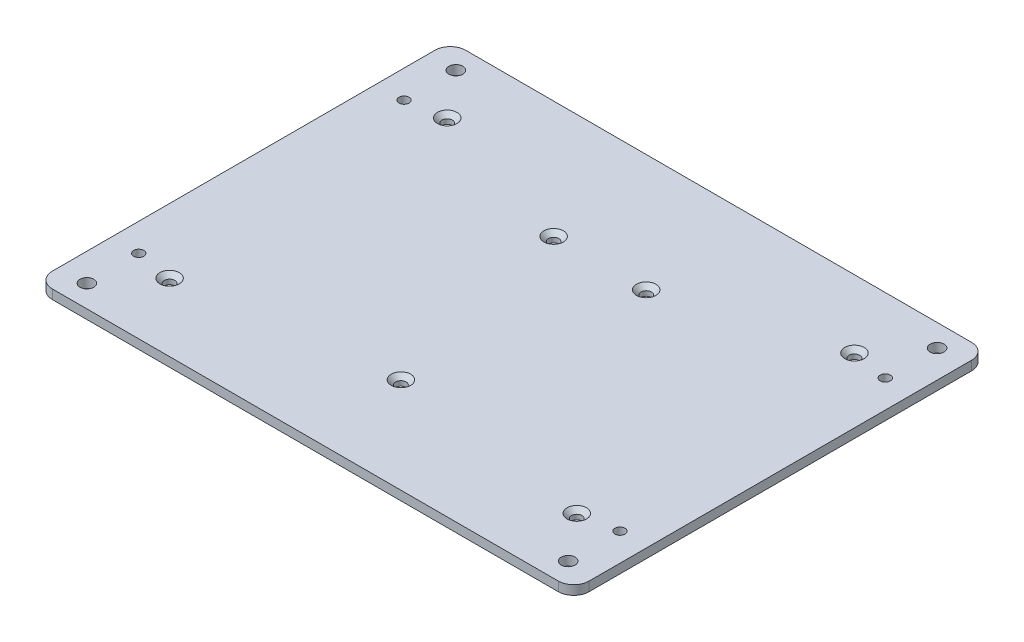
ISO-10303-21;
HEADER;
FILE_DESCRIPTION(('STEP AP214'),'2;1');
FILE_NAME('part.step','',(''),(''),'','','');
FILE_SCHEMA(('AUTOMOTIVE_DESIGN { 1 0 10303 214 1 1 1 1 }'));
ENDSEC;
DATA;
#1=APPLICATION_CONTEXT('core data for automotive mechanical design processes');
#2=APPLICATION_PROTOCOL_DEFINITION('international standard','automotive_design',2000,#1);
#3=PRODUCT_CONTEXT('',#1,'mechanical');
#4=PRODUCT('Part','Part','',(#3));
#5=PRODUCT_RELATED_PRODUCT_CATEGORY('part','',(#4));
#6=PRODUCT_DEFINITION_FORMATION('','',#4);
#7=PRODUCT_DEFINITION_CONTEXT('part definition',#1,'design');
#8=PRODUCT_DEFINITION('design','',#6,#7);
#9=PRODUCT_DEFINITION_SHAPE('','',#8);
#10=(LENGTH_UNIT() NAMED_UNIT(*) SI_UNIT(.MILLI.,.METRE.));
#11=(NAMED_UNIT(*) PLANE_ANGLE_UNIT() SI_UNIT($,.RADIAN.));
#12=(NAMED_UNIT(*) SI_UNIT($,.STERADIAN.) SOLID_ANGLE_UNIT());
#13=UNCERTAINTY_MEASURE_WITH_UNIT(LENGTH_MEASURE(1.E-05),#10,'distance_accuracy_value','');
#14=(GEOMETRIC_REPRESENTATION_CONTEXT(3) GLOBAL_UNCERTAINTY_ASSIGNED_CONTEXT((#13)) GLOBAL_UNIT_ASSIGNED_CONTEXT((#10,
#11,#12)) REPRESENTATION_CONTEXT('',''));
#15=CARTESIAN_POINT('',(0.,0.,0.));
#16=DIRECTION('',(0.,0.,1.));
#17=DIRECTION('',(1.,0.,0.));
#18=AXIS2_PLACEMENT_3D('',#15,#16,#17);
#19=CARTESIAN_POINT('',(-87.,3.,-67.));
#20=DIRECTION('',(1.,0.,0.));
#21=DIRECTION('',(0.,0.,-1.));
#22=AXIS2_PLACEMENT_3D('',#19,#20,#21);
#23=PLANE('',#22);
#24=DIRECTION('',(0.,0.,1.));
#25=VECTOR('',#24,1.);
#26=CARTESIAN_POINT('',(-87.,0.,-67.));
#27=LINE('',#26,#25);
#28=CARTESIAN_POINT('',(-87.,0.,-62.));
#29=VERTEX_POINT('',#28);
#30=CARTESIAN_POINT('',(-87.,0.,62.));
#31=VERTEX_POINT('',#30);
#32=EDGE_CURVE('E173',#29,#31,#27,.T.);
#33=ORIENTED_EDGE('',*,*,#32,.T.);
#34=DIRECTION('',(0.,-1.,0.));
#35=VECTOR('',#34,1.);
#36=CARTESIAN_POINT('',(-87.,3.,62.));
#37=LINE('',#36,#35);
#38=CARTESIAN_POINT('',(-87.,3.,62.));
#39=VERTEX_POINT('',#38);
#40=EDGE_CURVE('E11',#31,#39,#37,.F.);
#41=ORIENTED_EDGE('',*,*,#40,.T.);
#42=DIRECTION('',(0.,0.,1.));
#43=VECTOR('',#42,1.);
#44=CARTESIAN_POINT('',(-87.,3.,-67.));
#45=LINE('',#44,#43);
#46=CARTESIAN_POINT('',(-87.,3.,-62.));
#47=VERTEX_POINT('',#46);
#48=EDGE_CURVE('E141',#47,#39,#45,.T.);
#49=ORIENTED_EDGE('',*,*,#48,.F.);
#50=DIRECTION('',(0.,-1.,0.));
#51=VECTOR('',#50,1.);
#52=CARTESIAN_POINT('',(-87.,3.,-62.));
#53=LINE('',#52,#51);
#54=EDGE_CURVE('E57',#47,#29,#53,.T.);
#55=ORIENTED_EDGE('',*,*,#54,.T.);
#56=EDGE_LOOP('',(#33,#41,#49,#55));
#57=FACE_BOUND('',#56,.T.);
#58=ADVANCED_FACE('F49',(#57),#23,.F.);
#59=CARTESIAN_POINT('',(87.,3.,67.));
#60=DIRECTION('',(0.,0.,-1.));
#61=DIRECTION('',(-1.,0.,0.));
#62=AXIS2_PLACEMENT_3D('',#59,#60,#61);
#63=PLANE('',#62);
#64=DIRECTION('',(1.,0.,0.));
#65=VECTOR('',#64,1.);
#66=CARTESIAN_POINT('',(87.,0.,67.));
#67=LINE('',#66,#65);
#68=CARTESIAN_POINT('',(-81.9999999999999,0.,67.));
#69=VERTEX_POINT('',#68);
#70=CARTESIAN_POINT('',(82.,0.,67.));
#71=VERTEX_POINT('',#70);
#72=EDGE_CURVE('E146',#69,#71,#67,.T.);
#73=ORIENTED_EDGE('',*,*,#72,.T.);
#74=DIRECTION('',(0.,-1.,0.));
#75=VECTOR('',#74,1.);
#76=CARTESIAN_POINT('',(82.,3.,67.));
#77=LINE('',#76,#75);
#78=CARTESIAN_POINT('',(82.,3.,67.));
#79=VERTEX_POINT('',#78);
#80=EDGE_CURVE('E64',#71,#79,#77,.F.);
#81=ORIENTED_EDGE('',*,*,#80,.T.);
#82=DIRECTION('',(1.,0.,0.));
#83=VECTOR('',#82,1.);
#84=CARTESIAN_POINT('',(87.,3.,67.));
#85=LINE('',#84,#83);
#86=CARTESIAN_POINT('',(-81.9999999999999,3.,67.));
#87=VERTEX_POINT('',#86);
#88=EDGE_CURVE('E144',#87,#79,#85,.T.);
#89=ORIENTED_EDGE('',*,*,#88,.F.);
#90=DIRECTION('',(0.,-1.,0.));
#91=VECTOR('',#90,1.);
#92=CARTESIAN_POINT('',(-81.9999999999999,3.,67.));
#93=LINE('',#92,#91);
#94=EDGE_CURVE('E165',#87,#69,#93,.T.);
#95=ORIENTED_EDGE('',*,*,#94,.T.);
#96=EDGE_LOOP('',(#73,#81,#89,#95));
#97=FACE_BOUND('',#96,.T.);
#98=ADVANCED_FACE('F348',(#97),#63,.F.);
#99=CARTESIAN_POINT('',(87.,3.,-67.));
#100=DIRECTION('',(-1.,0.,0.));
#101=DIRECTION('',(0.,0.,1.));
#102=AXIS2_PLACEMENT_3D('',#99,#100,#101);
#103=PLANE('',#102);
#104=DIRECTION('',(0.,0.,-1.));
#105=VECTOR('',#104,1.);
#106=CARTESIAN_POINT('',(87.,0.,-67.));
#107=LINE('',#106,#105);
#108=CARTESIAN_POINT('',(87.,0.,62.));
#109=VERTEX_POINT('',#108);
#110=CARTESIAN_POINT('',(87.,0.,-62.));
#111=VERTEX_POINT('',#110);
#112=EDGE_CURVE('E142',#109,#111,#107,.T.);
#113=ORIENTED_EDGE('',*,*,#112,.T.);
#114=DIRECTION('',(0.,-1.,0.));
#115=VECTOR('',#114,1.);
#116=CARTESIAN_POINT('',(87.,3.,-62.));
#117=LINE('',#116,#115);
#118=CARTESIAN_POINT('',(87.,3.,-62.));
#119=VERTEX_POINT('',#118);
#120=EDGE_CURVE('E120',#111,#119,#117,.F.);
#121=ORIENTED_EDGE('',*,*,#120,.T.);
#122=DIRECTION('',(0.,0.,-1.));
#123=VECTOR('',#122,1.);
#124=CARTESIAN_POINT('',(87.,3.,-67.));
#125=LINE('',#124,#123);
#126=CARTESIAN_POINT('',(87.,3.,62.));
#127=VERTEX_POINT('',#126);
#128=EDGE_CURVE('E185',#127,#119,#125,.T.);
#129=ORIENTED_EDGE('',*,*,#128,.F.);
#130=DIRECTION('',(0.,-1.,0.));
#131=VECTOR('',#130,1.);
#132=CARTESIAN_POINT('',(87.,3.,62.));
#133=LINE('',#132,#131);
#134=EDGE_CURVE('E125',#127,#109,#133,.T.);
#135=ORIENTED_EDGE('',*,*,#134,.T.);
#136=EDGE_LOOP('',(#113,#121,#129,#135));
#137=FACE_BOUND('',#136,.T.);
#138=ADVANCED_FACE('F345',(#137),#103,.F.);
#139=CARTESIAN_POINT('',(87.,3.,-67.));
#140=DIRECTION('',(0.,0.,1.));
#141=DIRECTION('',(1.,0.,0.));
#142=AXIS2_PLACEMENT_3D('',#139,#140,#141);
#143=PLANE('',#142);
#144=DIRECTION('',(-1.,0.,0.));
#145=VECTOR('',#144,1.);
#146=CARTESIAN_POINT('',(87.,3.,-67.));
#147=LINE('',#146,#145);
#148=CARTESIAN_POINT('',(82.,3.,-67.));
#149=VERTEX_POINT('',#148);
#150=CARTESIAN_POINT('',(-82.,3.,-67.));
#151=VERTEX_POINT('',#150);
#152=EDGE_CURVE('E135',#149,#151,#147,.T.);
#153=ORIENTED_EDGE('',*,*,#152,.F.);
#154=DIRECTION('',(0.,-1.,0.));
#155=VECTOR('',#154,1.);
#156=CARTESIAN_POINT('',(82.,3.,-67.));
#157=LINE('',#156,#155);
#158=CARTESIAN_POINT('',(82.,0.,-67.));
#159=VERTEX_POINT('',#158);
#160=EDGE_CURVE('E119',#149,#159,#157,.T.);
#161=ORIENTED_EDGE('',*,*,#160,.T.);
#162=DIRECTION('',(-1.,0.,0.));
#163=VECTOR('',#162,1.);
#164=CARTESIAN_POINT('',(87.,0.,-67.));
#165=LINE('',#164,#163);
#166=CARTESIAN_POINT('',(-82.,0.,-67.));
#167=VERTEX_POINT('',#166);
#168=EDGE_CURVE('E132',#159,#167,#165,.T.);
#169=ORIENTED_EDGE('',*,*,#168,.T.);
#170=DIRECTION('',(0.,-1.,0.));
#171=VECTOR('',#170,1.);
#172=CARTESIAN_POINT('',(-82.,3.,-67.));
#173=LINE('',#172,#171);
#174=EDGE_CURVE('E137',#167,#151,#173,.F.);
#175=ORIENTED_EDGE('',*,*,#174,.T.);
#176=EDGE_LOOP('',(#153,#161,#169,#175));
#177=FACE_BOUND('',#176,.T.);
#178=ADVANCED_FACE('F131',(#177),#143,.F.);
#179=CARTESIAN_POINT('',(0.,3.,0.));
#180=DIRECTION('',(0.,-1.,0.));
#181=DIRECTION('',(0.,0.,-1.));
#182=AXIS2_PLACEMENT_3D('',#179,#180,#181);
#183=PLANE('',#182);
#184=CARTESIAN_POINT('',(-77.999137931034,3.,-59.799137931034));
#185=DIRECTION('',(0.,-1.,0.));
#186=DIRECTION('',(0.,0.,-1.));
#187=AXIS2_PLACEMENT_3D('',#184,#185,#186);
#188=CIRCLE('',#187,2.25);
#189=CARTESIAN_POINT('',(-77.999137931034,3.,-62.049137931034));
#190=VERTEX_POINT('',#189);
#191=EDGE_CURVE('E290',#190,#190,#188,.T.);
#192=ORIENTED_EDGE('',*,*,#191,.T.);
#193=EDGE_LOOP('',(#192));
#194=FACE_BOUND('',#193,.T.);
#195=CARTESIAN_POINT('',(77.999137931034,3.,-59.799137931034));
#196=DIRECTION('',(0.,-1.,0.));
#197=DIRECTION('',(0.,0.,-1.));
#198=AXIS2_PLACEMENT_3D('',#195,#196,#197);
#199=CIRCLE('',#198,2.25);
#200=CARTESIAN_POINT('',(77.999137931034,3.,-62.049137931034));
#201=VERTEX_POINT('',#200);
#202=EDGE_CURVE('E284',#201,#201,#199,.T.);
#203=ORIENTED_EDGE('',*,*,#202,.T.);
#204=EDGE_LOOP('',(#203));
#205=FACE_BOUND('',#204,.T.);
#206=CARTESIAN_POINT('',(77.999137931034,3.,59.799137931034));
#207=DIRECTION('',(0.,-1.,0.));
#208=DIRECTION('',(0.,0.,-1.));
#209=AXIS2_PLACEMENT_3D('',#206,#207,#208);
#210=CIRCLE('',#209,2.25);
#211=CARTESIAN_POINT('',(77.999137931034,3.,57.549137931034));
#212=VERTEX_POINT('',#211);
#213=EDGE_CURVE('E278',#212,#212,#210,.T.);
#214=ORIENTED_EDGE('',*,*,#213,.T.);
#215=EDGE_LOOP('',(#214));
#216=FACE_BOUND('',#215,.T.);
#217=CARTESIAN_POINT('',(-77.999137931034,3.,59.799137931034));
#218=DIRECTION('',(0.,-1.,0.));
#219=DIRECTION('',(0.,0.,-1.));
#220=AXIS2_PLACEMENT_3D('',#217,#218,#219);
#221=CIRCLE('',#220,2.25);
#222=CARTESIAN_POINT('',(-77.999137931034,3.,57.549137931034));
#223=VERTEX_POINT('',#222);
#224=EDGE_CURVE('E272',#223,#223,#221,.T.);
#225=ORIENTED_EDGE('',*,*,#224,.T.);
#226=EDGE_LOOP('',(#225));
#227=FACE_BOUND('',#226,.T.);
#228=CARTESIAN_POINT('',(0.,3.,36.));
#229=DIRECTION('',(0.,1.,0.));
#230=DIRECTION('',(0.,0.,1.));
#231=AXIS2_PLACEMENT_3D('',#228,#229,#230);
#232=CIRCLE('',#231,3.15);
#233=CARTESIAN_POINT('',(0.,3.,39.15));
#234=VERTEX_POINT('',#233);
#235=EDGE_CURVE('E269',#234,#234,#232,.T.);
#236=ORIENTED_EDGE('',*,*,#235,.F.);
#237=EDGE_LOOP('',(#236));
#238=FACE_BOUND('',#237,.T.);
#239=CARTESIAN_POINT('',(14.5,3.,-29.));
#240=DIRECTION('',(0.,1.,0.));
#241=DIRECTION('',(0.,0.,1.));
#242=AXIS2_PLACEMENT_3D('',#239,#240,#241);
#243=CIRCLE('',#242,3.15);
#244=CARTESIAN_POINT('',(14.5,3.,-25.85));
#245=VERTEX_POINT('',#244);
#246=EDGE_CURVE('E260',#245,#245,#243,.T.);
#247=ORIENTED_EDGE('',*,*,#246,.F.);
#248=EDGE_LOOP('',(#247));
#249=FACE_BOUND('',#248,.T.);
#250=CARTESIAN_POINT('',(-15.5,3.,-29.));
#251=DIRECTION('',(0.,1.,0.));
#252=DIRECTION('',(0.,0.,1.));
#253=AXIS2_PLACEMENT_3D('',#250,#251,#252);
#254=CIRCLE('',#253,3.15);
#255=CARTESIAN_POINT('',(-15.5,3.,-25.85));
#256=VERTEX_POINT('',#255);
#257=EDGE_CURVE('E251',#256,#256,#254,.T.);
#258=ORIENTED_EDGE('',*,*,#257,.F.);
#259=EDGE_LOOP('',(#258));
#260=FACE_BOUND('',#259,.T.);
#261=CARTESIAN_POINT('',(-66.,3.,-45.));
#262=DIRECTION('',(0.,1.,0.));
#263=DIRECTION('',(0.,0.,1.));
#264=AXIS2_PLACEMENT_3D('',#261,#262,#263);
#265=CIRCLE('',#264,3.15);
#266=CARTESIAN_POINT('',(-66.,3.,-41.85));
#267=VERTEX_POINT('',#266);
#268=EDGE_CURVE('E242',#267,#267,#265,.T.);
#269=ORIENTED_EDGE('',*,*,#268,.F.);
#270=EDGE_LOOP('',(#269));
#271=FACE_BOUND('',#270,.T.);
#272=CARTESIAN_POINT('',(66.,3.,-45.));
#273=DIRECTION('',(0.,1.,0.));
#274=DIRECTION('',(0.,0.,1.));
#275=AXIS2_PLACEMENT_3D('',#272,#273,#274);
#276=CIRCLE('',#275,3.15);
#277=CARTESIAN_POINT('',(66.,3.,-41.85));
#278=VERTEX_POINT('',#277);
#279=EDGE_CURVE('E233',#278,#278,#276,.T.);
#280=ORIENTED_EDGE('',*,*,#279,.F.);
#281=EDGE_LOOP('',(#280));
#282=FACE_BOUND('',#281,.T.);
#283=CARTESIAN_POINT('',(-66.,3.,45.));
#284=DIRECTION('',(0.,1.,0.));
#285=DIRECTION('',(0.,0.,1.));
#286=AXIS2_PLACEMENT_3D('',#283,#284,#285);
#287=CIRCLE('',#286,3.15);
#288=CARTESIAN_POINT('',(-66.,3.,48.15));
#289=VERTEX_POINT('',#288);
#290=EDGE_CURVE('E224',#289,#289,#287,.T.);
#291=ORIENTED_EDGE('',*,*,#290,.F.);
#292=EDGE_LOOP('',(#291));
#293=FACE_BOUND('',#292,.T.);
#294=CARTESIAN_POINT('',(66.,3.,45.));
#295=DIRECTION('',(0.,1.,0.));
#296=DIRECTION('',(0.,0.,1.));
#297=AXIS2_PLACEMENT_3D('',#294,#295,#296);
#298=CIRCLE('',#297,3.15);
#299=CARTESIAN_POINT('',(66.,3.,48.15));
#300=VERTEX_POINT('',#299);
#301=EDGE_CURVE('E215',#300,#300,#298,.T.);
#302=ORIENTED_EDGE('',*,*,#301,.F.);
#303=EDGE_LOOP('',(#302));
#304=FACE_BOUND('',#303,.T.);
#305=CARTESIAN_POINT('',(-77.999137931034,3.,-42.999137931034));
#306=DIRECTION('',(0.,1.,0.));
#307=DIRECTION('',(0.,0.,1.));
#308=AXIS2_PLACEMENT_3D('',#305,#306,#307);
#309=CIRCLE('',#308,1.65);
#310=CARTESIAN_POINT('',(-77.999137931034,3.,-41.349137931034));
#311=VERTEX_POINT('',#310);
#312=EDGE_CURVE('E206',#311,#311,#309,.T.);
#313=ORIENTED_EDGE('',*,*,#312,.F.);
#314=EDGE_LOOP('',(#313));
#315=FACE_BOUND('',#314,.T.);
#316=CARTESIAN_POINT('',(77.99913793103,3.,-42.999137931034));
#317=DIRECTION('',(0.,1.,0.));
#318=DIRECTION('',(0.,0.,1.));
#319=AXIS2_PLACEMENT_3D('',#316,#317,#318);
#320=CIRCLE('',#319,1.65);
#321=CARTESIAN_POINT('',(77.99913793103,3.,-41.349137931034));
#322=VERTEX_POINT('',#321);
#323=EDGE_CURVE('E200',#322,#322,#320,.T.);
#324=ORIENTED_EDGE('',*,*,#323,.F.);
#325=EDGE_LOOP('',(#324));
#326=FACE_BOUND('',#325,.T.);
#327=CARTESIAN_POINT('',(77.99913793103,3.,42.999137931035));
#328=DIRECTION('',(0.,1.,0.));
#329=DIRECTION('',(0.,0.,1.));
#330=AXIS2_PLACEMENT_3D('',#327,#328,#329);
#331=CIRCLE('',#330,1.65);
#332=CARTESIAN_POINT('',(77.99913793103,3.,44.649137931035));
#333=VERTEX_POINT('',#332);
#334=EDGE_CURVE('E194',#333,#333,#331,.T.);
#335=ORIENTED_EDGE('',*,*,#334,.F.);
#336=EDGE_LOOP('',(#335));
#337=FACE_BOUND('',#336,.T.);
#338=CARTESIAN_POINT('',(-77.999137931034,3.,42.999137931035));
#339=DIRECTION('',(0.,1.,0.));
#340=DIRECTION('',(0.,0.,1.));
#341=AXIS2_PLACEMENT_3D('',#338,#339,#340);
#342=CIRCLE('',#341,1.65);
#343=CARTESIAN_POINT('',(-77.999137931034,3.,44.649137931035));
#344=VERTEX_POINT('',#343);
#345=EDGE_CURVE('E181',#344,#344,#342,.T.);
#346=ORIENTED_EDGE('',*,*,#345,.F.);
#347=EDGE_LOOP('',(#346));
#348=FACE_BOUND('',#347,.T.);
#349=ORIENTED_EDGE('',*,*,#128,.T.);
#350=CARTESIAN_POINT('',(82.,3.,-62.));
#351=DIRECTION('',(0.,-1.,0.));
#352=DIRECTION('',(0.,0.,-1.));
#353=AXIS2_PLACEMENT_3D('',#350,#351,#352);
#354=CIRCLE('',#353,5.);
#355=EDGE_CURVE('E163',#119,#149,#354,.F.);
#356=ORIENTED_EDGE('',*,*,#355,.T.);
#357=ORIENTED_EDGE('',*,*,#152,.T.);
#358=CARTESIAN_POINT('',(-82.,3.,-62.));
#359=DIRECTION('',(0.,-1.,0.));
#360=DIRECTION('',(0.,0.,-1.));
#361=AXIS2_PLACEMENT_3D('',#358,#359,#360);
#362=CIRCLE('',#361,5.);
#363=EDGE_CURVE('E158',#151,#47,#362,.F.);
#364=ORIENTED_EDGE('',*,*,#363,.T.);
#365=ORIENTED_EDGE('',*,*,#48,.T.);
#366=CARTESIAN_POINT('',(-81.9999999999999,3.,62.));
#367=DIRECTION('',(0.,-1.,0.));
#368=DIRECTION('',(0.,0.,-1.));
#369=AXIS2_PLACEMENT_3D('',#366,#367,#368);
#370=CIRCLE('',#369,5.);
#371=EDGE_CURVE('E71',#39,#87,#370,.F.);
#372=ORIENTED_EDGE('',*,*,#371,.T.);
#373=ORIENTED_EDGE('',*,*,#88,.T.);
#374=CARTESIAN_POINT('',(82.,3.,62.));
#375=DIRECTION('',(0.,-1.,0.));
#376=DIRECTION('',(0.,0.,-1.));
#377=AXIS2_PLACEMENT_3D('',#374,#375,#376);
#378=CIRCLE('',#377,5.);
#379=EDGE_CURVE('E161',#79,#127,#378,.F.);
#380=ORIENTED_EDGE('',*,*,#379,.T.);
#381=EDGE_LOOP('',(#349,#356,#357,#364,#365,#372,#373,#380));
#382=FACE_BOUND('',#381,.T.);
#383=ADVANCED_FACE('F302',(#194,#205,#216,#227,#238,#249,#260,#271,#282,#293,#304,#315,#326,
#337,#348,#382),#183,.F.);
#384=CARTESIAN_POINT('',(0.,0.,0.));
#385=DIRECTION('',(0.,-1.,0.));
#386=DIRECTION('',(0.,0.,-1.));
#387=AXIS2_PLACEMENT_3D('',#384,#385,#386);
#388=PLANE('',#387);
#389=CARTESIAN_POINT('',(-77.999137931034,0.,-59.799137931034));
#390=DIRECTION('',(0.,-1.,0.));
#391=DIRECTION('',(0.,0.,-1.));
#392=AXIS2_PLACEMENT_3D('',#389,#390,#391);
#393=CIRCLE('',#392,2.25);
#394=CARTESIAN_POINT('',(-77.999137931034,0.,-62.049137931034));
#395=VERTEX_POINT('',#394);
#396=EDGE_CURVE('E293',#395,#395,#393,.T.);
#397=ORIENTED_EDGE('',*,*,#396,.F.);
#398=EDGE_LOOP('',(#397));
#399=FACE_BOUND('',#398,.T.);
#400=CARTESIAN_POINT('',(77.999137931034,0.,-59.799137931034));
#401=DIRECTION('',(0.,-1.,0.));
#402=DIRECTION('',(0.,0.,-1.));
#403=AXIS2_PLACEMENT_3D('',#400,#401,#402);
#404=CIRCLE('',#403,2.25);
#405=CARTESIAN_POINT('',(77.999137931034,0.,-62.049137931034));
#406=VERTEX_POINT('',#405);
#407=EDGE_CURVE('E287',#406,#406,#404,.T.);
#408=ORIENTED_EDGE('',*,*,#407,.F.);
#409=EDGE_LOOP('',(#408));
#410=FACE_BOUND('',#409,.T.);
#411=CARTESIAN_POINT('',(77.999137931034,0.,59.799137931034));
#412=DIRECTION('',(0.,-1.,0.));
#413=DIRECTION('',(0.,0.,-1.));
#414=AXIS2_PLACEMENT_3D('',#411,#412,#413);
#415=CIRCLE('',#414,2.25);
#416=CARTESIAN_POINT('',(77.999137931034,0.,57.549137931034));
#417=VERTEX_POINT('',#416);
#418=EDGE_CURVE('E281',#417,#417,#415,.T.);
#419=ORIENTED_EDGE('',*,*,#418,.F.);
#420=EDGE_LOOP('',(#419));
#421=FACE_BOUND('',#420,.T.);
#422=CARTESIAN_POINT('',(-77.999137931034,0.,59.799137931034));
#423=DIRECTION('',(0.,-1.,0.));
#424=DIRECTION('',(0.,0.,-1.));
#425=AXIS2_PLACEMENT_3D('',#422,#423,#424);
#426=CIRCLE('',#425,2.25);
#427=CARTESIAN_POINT('',(-77.999137931034,0.,57.549137931034));
#428=VERTEX_POINT('',#427);
#429=EDGE_CURVE('E275',#428,#428,#426,.T.);
#430=ORIENTED_EDGE('',*,*,#429,.F.);
#431=EDGE_LOOP('',(#430));
#432=FACE_BOUND('',#431,.T.);
#433=CARTESIAN_POINT('',(0.,0.,36.));
#434=DIRECTION('',(0.,1.,0.));
#435=DIRECTION('',(0.,0.,1.));
#436=AXIS2_PLACEMENT_3D('',#433,#434,#435);
#437=CIRCLE('',#436,1.7);
#438=CARTESIAN_POINT('',(0.,0.,37.7));
#439=VERTEX_POINT('',#438);
#440=EDGE_CURVE('E263',#439,#439,#437,.T.);
#441=ORIENTED_EDGE('',*,*,#440,.T.);
#442=EDGE_LOOP('',(#441));
#443=FACE_BOUND('',#442,.T.);
#444=CARTESIAN_POINT('',(14.5,0.,-29.));
#445=DIRECTION('',(0.,1.,0.));
#446=DIRECTION('',(0.,0.,1.));
#447=AXIS2_PLACEMENT_3D('',#444,#445,#446);
#448=CIRCLE('',#447,1.7);
#449=CARTESIAN_POINT('',(14.5,0.,-27.3));
#450=VERTEX_POINT('',#449);
#451=EDGE_CURVE('E254',#450,#450,#448,.T.);
#452=ORIENTED_EDGE('',*,*,#451,.T.);
#453=EDGE_LOOP('',(#452));
#454=FACE_BOUND('',#453,.T.);
#455=CARTESIAN_POINT('',(-15.5,0.,-29.));
#456=DIRECTION('',(0.,1.,0.));
#457=DIRECTION('',(0.,0.,1.));
#458=AXIS2_PLACEMENT_3D('',#455,#456,#457);
#459=CIRCLE('',#458,1.7);
#460=CARTESIAN_POINT('',(-15.5,0.,-27.3));
#461=VERTEX_POINT('',#460);
#462=EDGE_CURVE('E245',#461,#461,#459,.T.);
#463=ORIENTED_EDGE('',*,*,#462,.T.);
#464=EDGE_LOOP('',(#463));
#465=FACE_BOUND('',#464,.T.);
#466=CARTESIAN_POINT('',(-66.,0.,-45.));
#467=DIRECTION('',(0.,1.,0.));
#468=DIRECTION('',(0.,0.,1.));
#469=AXIS2_PLACEMENT_3D('',#466,#467,#468);
#470=CIRCLE('',#469,1.69999999999999);
#471=CARTESIAN_POINT('',(-66.,0.,-43.3));
#472=VERTEX_POINT('',#471);
#473=EDGE_CURVE('E236',#472,#472,#470,.T.);
#474=ORIENTED_EDGE('',*,*,#473,.T.);
#475=EDGE_LOOP('',(#474));
#476=FACE_BOUND('',#475,.T.);
#477=CARTESIAN_POINT('',(66.,0.,-45.));
#478=DIRECTION('',(0.,1.,0.));
#479=DIRECTION('',(0.,0.,1.));
#480=AXIS2_PLACEMENT_3D('',#477,#478,#479);
#481=CIRCLE('',#480,1.69999999999999);
#482=CARTESIAN_POINT('',(66.,0.,-43.3));
#483=VERTEX_POINT('',#482);
#484=EDGE_CURVE('E227',#483,#483,#481,.T.);
#485=ORIENTED_EDGE('',*,*,#484,.T.);
#486=EDGE_LOOP('',(#485));
#487=FACE_BOUND('',#486,.T.);
#488=CARTESIAN_POINT('',(-66.,0.,45.));
#489=DIRECTION('',(0.,1.,0.));
#490=DIRECTION('',(0.,0.,1.));
#491=AXIS2_PLACEMENT_3D('',#488,#489,#490);
#492=CIRCLE('',#491,1.69999999999999);
#493=CARTESIAN_POINT('',(-66.,0.,46.7));
#494=VERTEX_POINT('',#493);
#495=EDGE_CURVE('E218',#494,#494,#492,.T.);
#496=ORIENTED_EDGE('',*,*,#495,.T.);
#497=EDGE_LOOP('',(#496));
#498=FACE_BOUND('',#497,.T.);
#499=CARTESIAN_POINT('',(66.,0.,45.));
#500=DIRECTION('',(0.,1.,0.));
#501=DIRECTION('',(0.,0.,1.));
#502=AXIS2_PLACEMENT_3D('',#499,#500,#501);
#503=CIRCLE('',#502,1.69999999999999);
#504=CARTESIAN_POINT('',(66.,0.,46.7));
#505=VERTEX_POINT('',#504);
#506=EDGE_CURVE('E209',#505,#505,#503,.T.);
#507=ORIENTED_EDGE('',*,*,#506,.T.);
#508=EDGE_LOOP('',(#507));
#509=FACE_BOUND('',#508,.T.);
#510=CARTESIAN_POINT('',(-77.999137931034,0.,-42.999137931034));
#511=DIRECTION('',(0.,1.,0.));
#512=DIRECTION('',(0.,0.,1.));
#513=AXIS2_PLACEMENT_3D('',#510,#511,#512);
#514=CIRCLE('',#513,1.65);
#515=CARTESIAN_POINT('',(-77.999137931034,0.,-41.349137931034));
#516=VERTEX_POINT('',#515);
#517=EDGE_CURVE('E203',#516,#516,#514,.T.);
#518=ORIENTED_EDGE('',*,*,#517,.T.);
#519=EDGE_LOOP('',(#518));
#520=FACE_BOUND('',#519,.T.);
#521=CARTESIAN_POINT('',(77.99913793103,0.,-42.999137931034));
#522=DIRECTION('',(0.,1.,0.));
#523=DIRECTION('',(0.,0.,1.));
#524=AXIS2_PLACEMENT_3D('',#521,#522,#523);
#525=CIRCLE('',#524,1.65);
#526=CARTESIAN_POINT('',(77.99913793103,0.,-41.349137931034));
#527=VERTEX_POINT('',#526);
#528=EDGE_CURVE('E197',#527,#527,#525,.T.);
#529=ORIENTED_EDGE('',*,*,#528,.T.);
#530=EDGE_LOOP('',(#529));
#531=FACE_BOUND('',#530,.T.);
#532=CARTESIAN_POINT('',(77.99913793103,0.,42.999137931035));
#533=DIRECTION('',(0.,1.,0.));
#534=DIRECTION('',(0.,0.,1.));
#535=AXIS2_PLACEMENT_3D('',#532,#533,#534);
#536=CIRCLE('',#535,1.65);
#537=CARTESIAN_POINT('',(77.99913793103,0.,44.649137931035));
#538=VERTEX_POINT('',#537);
#539=EDGE_CURVE('E191',#538,#538,#536,.T.);
#540=ORIENTED_EDGE('',*,*,#539,.T.);
#541=EDGE_LOOP('',(#540));
#542=FACE_BOUND('',#541,.T.);
#543=CARTESIAN_POINT('',(-77.999137931034,0.,42.999137931035));
#544=DIRECTION('',(0.,1.,0.));
#545=DIRECTION('',(0.,0.,1.));
#546=AXIS2_PLACEMENT_3D('',#543,#544,#545);
#547=CIRCLE('',#546,1.65);
#548=CARTESIAN_POINT('',(-77.999137931034,0.,44.649137931035));
#549=VERTEX_POINT('',#548);
#550=EDGE_CURVE('E178',#549,#549,#547,.T.);
#551=ORIENTED_EDGE('',*,*,#550,.T.);
#552=EDGE_LOOP('',(#551));
#553=FACE_BOUND('',#552,.T.);
#554=ORIENTED_EDGE('',*,*,#168,.F.);
#555=CARTESIAN_POINT('',(82.,0.,-62.));
#556=DIRECTION('',(0.,-1.,0.));
#557=DIRECTION('',(0.,0.,-1.));
#558=AXIS2_PLACEMENT_3D('',#555,#556,#557);
#559=CIRCLE('',#558,5.);
#560=EDGE_CURVE('E115',#159,#111,#559,.T.);
#561=ORIENTED_EDGE('',*,*,#560,.T.);
#562=ORIENTED_EDGE('',*,*,#112,.F.);
#563=CARTESIAN_POINT('',(82.,0.,62.));
#564=DIRECTION('',(0.,-1.,0.));
#565=DIRECTION('',(0.,0.,-1.));
#566=AXIS2_PLACEMENT_3D('',#563,#564,#565);
#567=CIRCLE('',#566,5.);
#568=EDGE_CURVE('E126',#109,#71,#567,.T.);
#569=ORIENTED_EDGE('',*,*,#568,.T.);
#570=ORIENTED_EDGE('',*,*,#72,.F.);
#571=CARTESIAN_POINT('',(-81.9999999999999,0.,62.));
#572=DIRECTION('',(0.,-1.,0.));
#573=DIRECTION('',(0.,0.,-1.));
#574=AXIS2_PLACEMENT_3D('',#571,#572,#573);
#575=CIRCLE('',#574,5.);
#576=EDGE_CURVE('E152',#69,#31,#575,.T.);
#577=ORIENTED_EDGE('',*,*,#576,.T.);
#578=ORIENTED_EDGE('',*,*,#32,.F.);
#579=CARTESIAN_POINT('',(-82.,0.,-62.));
#580=DIRECTION('',(0.,-1.,0.));
#581=DIRECTION('',(0.,0.,-1.));
#582=AXIS2_PLACEMENT_3D('',#579,#580,#581);
#583=CIRCLE('',#582,5.);
#584=EDGE_CURVE('E136',#29,#167,#583,.T.);
#585=ORIENTED_EDGE('',*,*,#584,.T.);
#586=EDGE_LOOP('',(#554,#561,#562,#569,#570,#577,#578,#585));
#587=FACE_BOUND('',#586,.T.);
#588=ADVANCED_FACE('F139',(#399,#410,#421,#432,#443,#454,#465,#476,#487,#498,#509,#520,#531,
#542,#553,#587),#388,.T.);
#589=CARTESIAN_POINT('',(-77.999137931034,3.,42.999137931035));
#590=DIRECTION('',(0.,1.,0.));
#591=DIRECTION('',(0.,0.,1.));
#592=AXIS2_PLACEMENT_3D('',#589,#590,#591);
#593=CYLINDRICAL_SURFACE('',#592,1.65);
#594=ORIENTED_EDGE('',*,*,#550,.F.);
#595=EDGE_LOOP('',(#594));
#596=FACE_BOUND('',#595,.T.);
#597=ORIENTED_EDGE('',*,*,#345,.T.);
#598=EDGE_LOOP('',(#597));
#599=FACE_BOUND('',#598,.T.);
#600=ADVANCED_FACE('F301',(#596,#599),#593,.F.);
#601=CARTESIAN_POINT('',(77.99913793103,3.,42.999137931035));
#602=DIRECTION('',(0.,1.,0.));
#603=DIRECTION('',(0.,0.,1.));
#604=AXIS2_PLACEMENT_3D('',#601,#602,#603);
#605=CYLINDRICAL_SURFACE('',#604,1.65);
#606=ORIENTED_EDGE('',*,*,#539,.F.);
#607=EDGE_LOOP('',(#606));
#608=FACE_BOUND('',#607,.T.);
#609=ORIENTED_EDGE('',*,*,#334,.T.);
#610=EDGE_LOOP('',(#609));
#611=FACE_BOUND('',#610,.T.);
#612=ADVANCED_FACE('F334',(#608,#611),#605,.F.);
#613=CARTESIAN_POINT('',(77.99913793103,3.,-42.999137931034));
#614=DIRECTION('',(0.,1.,0.));
#615=DIRECTION('',(0.,0.,1.));
#616=AXIS2_PLACEMENT_3D('',#613,#614,#615);
#617=CYLINDRICAL_SURFACE('',#616,1.65);
#618=ORIENTED_EDGE('',*,*,#528,.F.);
#619=EDGE_LOOP('',(#618));
#620=FACE_BOUND('',#619,.T.);
#621=ORIENTED_EDGE('',*,*,#323,.T.);
#622=EDGE_LOOP('',(#621));
#623=FACE_BOUND('',#622,.T.);
#624=ADVANCED_FACE('F584',(#620,#623),#617,.F.);
#625=CARTESIAN_POINT('',(-77.999137931034,3.,-42.999137931034));
#626=DIRECTION('',(0.,1.,0.));
#627=DIRECTION('',(0.,0.,1.));
#628=AXIS2_PLACEMENT_3D('',#625,#626,#627);
#629=CYLINDRICAL_SURFACE('',#628,1.65);
#630=ORIENTED_EDGE('',*,*,#517,.F.);
#631=EDGE_LOOP('',(#630));
#632=FACE_BOUND('',#631,.T.);
#633=ORIENTED_EDGE('',*,*,#312,.T.);
#634=EDGE_LOOP('',(#633));
#635=FACE_BOUND('',#634,.T.);
#636=ADVANCED_FACE('F372',(#632,#635),#629,.F.);
#637=CARTESIAN_POINT('',(82.,3.,-62.));
#638=DIRECTION('',(0.,-1.,0.));
#639=DIRECTION('',(0.,0.,-1.));
#640=AXIS2_PLACEMENT_3D('',#637,#638,#639);
#641=CYLINDRICAL_SURFACE('',#640,5.);
#642=ORIENTED_EDGE('',*,*,#355,.F.);
#643=ORIENTED_EDGE('',*,*,#120,.F.);
#644=ORIENTED_EDGE('',*,*,#560,.F.);
#645=ORIENTED_EDGE('',*,*,#160,.F.);
#646=EDGE_LOOP('',(#642,#643,#644,#645));
#647=FACE_BOUND('',#646,.T.);
#648=ADVANCED_FACE('F118',(#647),#641,.T.);
#649=CARTESIAN_POINT('',(82.,3.,62.));
#650=DIRECTION('',(0.,-1.,0.));
#651=DIRECTION('',(0.,0.,-1.));
#652=AXIS2_PLACEMENT_3D('',#649,#650,#651);
#653=CYLINDRICAL_SURFACE('',#652,5.);
#654=ORIENTED_EDGE('',*,*,#379,.F.);
#655=ORIENTED_EDGE('',*,*,#80,.F.);
#656=ORIENTED_EDGE('',*,*,#568,.F.);
#657=ORIENTED_EDGE('',*,*,#134,.F.);
#658=EDGE_LOOP('',(#654,#655,#656,#657));
#659=FACE_BOUND('',#658,.T.);
#660=ADVANCED_FACE('F347',(#659),#653,.T.);
#661=CARTESIAN_POINT('',(-81.9999999999999,3.,62.));
#662=DIRECTION('',(0.,-1.,0.));
#663=DIRECTION('',(0.,0.,-1.));
#664=AXIS2_PLACEMENT_3D('',#661,#662,#663);
#665=CYLINDRICAL_SURFACE('',#664,5.);
#666=ORIENTED_EDGE('',*,*,#371,.F.);
#667=ORIENTED_EDGE('',*,*,#40,.F.);
#668=ORIENTED_EDGE('',*,*,#576,.F.);
#669=ORIENTED_EDGE('',*,*,#94,.F.);
#670=EDGE_LOOP('',(#666,#667,#668,#669));
#671=FACE_BOUND('',#670,.T.);
#672=ADVANCED_FACE('F351',(#671),#665,.T.);
#673=CARTESIAN_POINT('',(-82.,3.,-62.));
#674=DIRECTION('',(0.,-1.,0.));
#675=DIRECTION('',(0.,0.,-1.));
#676=AXIS2_PLACEMENT_3D('',#673,#674,#675);
#677=CYLINDRICAL_SURFACE('',#676,5.);
#678=ORIENTED_EDGE('',*,*,#363,.F.);
#679=ORIENTED_EDGE('',*,*,#174,.F.);
#680=ORIENTED_EDGE('',*,*,#584,.F.);
#681=ORIENTED_EDGE('',*,*,#54,.F.);
#682=EDGE_LOOP('',(#678,#679,#680,#681));
#683=FACE_BOUND('',#682,.T.);
#684=ADVANCED_FACE('F51',(#683),#677,.T.);
#685=CARTESIAN_POINT('',(66.,3.,45.));
#686=DIRECTION('',(0.,1.,0.));
#687=DIRECTION('',(0.,0.,1.));
#688=AXIS2_PLACEMENT_3D('',#685,#686,#687);
#689=CYLINDRICAL_SURFACE('',#688,1.69999999999999);
#690=ORIENTED_EDGE('',*,*,#506,.F.);
#691=EDGE_LOOP('',(#690));
#692=FACE_BOUND('',#691,.T.);
#693=CARTESIAN_POINT('',(66.,1.55,45.));
#694=DIRECTION('',(0.,1.,0.));
#695=DIRECTION('',(0.,0.,1.));
#696=AXIS2_PLACEMENT_3D('',#693,#694,#695);
#697=CIRCLE('',#696,1.69999999999999);
#698=CARTESIAN_POINT('',(66.,1.55,46.7));
#699=VERTEX_POINT('',#698);
#700=EDGE_CURVE('E212',#699,#699,#697,.T.);
#701=ORIENTED_EDGE('',*,*,#700,.T.);
#702=EDGE_LOOP('',(#701));
#703=FACE_BOUND('',#702,.T.);
#704=ADVANCED_FACE('F353',(#692,#703),#689,.F.);
#705=CARTESIAN_POINT('',(66.,3.,45.));
#706=DIRECTION('',(0.,1.,0.));
#707=DIRECTION('',(0.,0.,1.));
#708=AXIS2_PLACEMENT_3D('',#705,#706,#707);
#709=CONICAL_SURFACE('',#708,3.15,0.78539816339745);
#710=ORIENTED_EDGE('',*,*,#700,.F.);
#711=EDGE_LOOP('',(#710));
#712=FACE_BOUND('',#711,.T.);
#713=ORIENTED_EDGE('',*,*,#301,.T.);
#714=EDGE_LOOP('',(#713));
#715=FACE_BOUND('',#714,.T.);
#716=ADVANCED_FACE('F358',(#712,#715),#709,.F.);
#717=CARTESIAN_POINT('',(-66.,3.,45.));
#718=DIRECTION('',(0.,1.,0.));
#719=DIRECTION('',(0.,0.,1.));
#720=AXIS2_PLACEMENT_3D('',#717,#718,#719);
#721=CYLINDRICAL_SURFACE('',#720,1.69999999999999);
#722=ORIENTED_EDGE('',*,*,#495,.F.);
#723=EDGE_LOOP('',(#722));
#724=FACE_BOUND('',#723,.T.);
#725=CARTESIAN_POINT('',(-66.,1.55,45.));
#726=DIRECTION('',(0.,1.,0.));
#727=DIRECTION('',(0.,0.,1.));
#728=AXIS2_PLACEMENT_3D('',#725,#726,#727);
#729=CIRCLE('',#728,1.69999999999999);
#730=CARTESIAN_POINT('',(-66.,1.55,46.7));
#731=VERTEX_POINT('',#730);
#732=EDGE_CURVE('E221',#731,#731,#729,.T.);
#733=ORIENTED_EDGE('',*,*,#732,.T.);
#734=EDGE_LOOP('',(#733));
#735=FACE_BOUND('',#734,.T.);
#736=ADVANCED_FACE('F405',(#724,#735),#721,.F.);
#737=CARTESIAN_POINT('',(-66.,3.,45.));
#738=DIRECTION('',(0.,1.,0.));
#739=DIRECTION('',(0.,0.,1.));
#740=AXIS2_PLACEMENT_3D('',#737,#738,#739);
#741=CONICAL_SURFACE('',#740,3.15,0.78539816339745);
#742=ORIENTED_EDGE('',*,*,#732,.F.);
#743=EDGE_LOOP('',(#742));
#744=FACE_BOUND('',#743,.T.);
#745=ORIENTED_EDGE('',*,*,#290,.T.);
#746=EDGE_LOOP('',(#745));
#747=FACE_BOUND('',#746,.T.);
#748=ADVANCED_FACE('F416',(#744,#747),#741,.F.);
#749=CARTESIAN_POINT('',(66.,3.,-45.));
#750=DIRECTION('',(0.,1.,0.));
#751=DIRECTION('',(0.,0.,1.));
#752=AXIS2_PLACEMENT_3D('',#749,#750,#751);
#753=CYLINDRICAL_SURFACE('',#752,1.69999999999999);
#754=ORIENTED_EDGE('',*,*,#484,.F.);
#755=EDGE_LOOP('',(#754));
#756=FACE_BOUND('',#755,.T.);
#757=CARTESIAN_POINT('',(66.,1.55,-45.));
#758=DIRECTION('',(0.,1.,0.));
#759=DIRECTION('',(0.,0.,1.));
#760=AXIS2_PLACEMENT_3D('',#757,#758,#759);
#761=CIRCLE('',#760,1.69999999999999);
#762=CARTESIAN_POINT('',(66.,1.55,-43.3));
#763=VERTEX_POINT('',#762);
#764=EDGE_CURVE('E230',#763,#763,#761,.T.);
#765=ORIENTED_EDGE('',*,*,#764,.T.);
#766=EDGE_LOOP('',(#765));
#767=FACE_BOUND('',#766,.T.);
#768=ADVANCED_FACE('F427',(#756,#767),#753,.F.);
#769=CARTESIAN_POINT('',(66.,3.,-45.));
#770=DIRECTION('',(0.,1.,0.));
#771=DIRECTION('',(0.,0.,1.));
#772=AXIS2_PLACEMENT_3D('',#769,#770,#771);
#773=CONICAL_SURFACE('',#772,3.15,0.78539816339745);
#774=ORIENTED_EDGE('',*,*,#764,.F.);
#775=EDGE_LOOP('',(#774));
#776=FACE_BOUND('',#775,.T.);
#777=ORIENTED_EDGE('',*,*,#279,.T.);
#778=EDGE_LOOP('',(#777));
#779=FACE_BOUND('',#778,.T.);
#780=ADVANCED_FACE('F438',(#776,#779),#773,.F.);
#781=CARTESIAN_POINT('',(-66.,3.,-45.));
#782=DIRECTION('',(0.,1.,0.));
#783=DIRECTION('',(0.,0.,1.));
#784=AXIS2_PLACEMENT_3D('',#781,#782,#783);
#785=CYLINDRICAL_SURFACE('',#784,1.69999999999999);
#786=ORIENTED_EDGE('',*,*,#473,.F.);
#787=EDGE_LOOP('',(#786));
#788=FACE_BOUND('',#787,.T.);
#789=CARTESIAN_POINT('',(-66.,1.55,-45.));
#790=DIRECTION('',(0.,1.,0.));
#791=DIRECTION('',(0.,0.,1.));
#792=AXIS2_PLACEMENT_3D('',#789,#790,#791);
#793=CIRCLE('',#792,1.69999999999999);
#794=CARTESIAN_POINT('',(-66.,1.55,-43.3));
#795=VERTEX_POINT('',#794);
#796=EDGE_CURVE('E239',#795,#795,#793,.T.);
#797=ORIENTED_EDGE('',*,*,#796,.T.);
#798=EDGE_LOOP('',(#797));
#799=FACE_BOUND('',#798,.T.);
#800=ADVANCED_FACE('F449',(#788,#799),#785,.F.);
#801=CARTESIAN_POINT('',(-66.,3.,-45.));
#802=DIRECTION('',(0.,1.,0.));
#803=DIRECTION('',(0.,0.,1.));
#804=AXIS2_PLACEMENT_3D('',#801,#802,#803);
#805=CONICAL_SURFACE('',#804,3.15,0.78539816339745);
#806=ORIENTED_EDGE('',*,*,#796,.F.);
#807=EDGE_LOOP('',(#806));
#808=FACE_BOUND('',#807,.T.);
#809=ORIENTED_EDGE('',*,*,#268,.T.);
#810=EDGE_LOOP('',(#809));
#811=FACE_BOUND('',#810,.T.);
#812=ADVANCED_FACE('F460',(#808,#811),#805,.F.);
#813=CARTESIAN_POINT('',(-15.5,3.,-29.));
#814=DIRECTION('',(0.,1.,0.));
#815=DIRECTION('',(0.,0.,1.));
#816=AXIS2_PLACEMENT_3D('',#813,#814,#815);
#817=CYLINDRICAL_SURFACE('',#816,1.7);
#818=ORIENTED_EDGE('',*,*,#462,.F.);
#819=EDGE_LOOP('',(#818));
#820=FACE_BOUND('',#819,.T.);
#821=CARTESIAN_POINT('',(-15.5,1.55,-29.));
#822=DIRECTION('',(0.,1.,0.));
#823=DIRECTION('',(0.,0.,1.));
#824=AXIS2_PLACEMENT_3D('',#821,#822,#823);
#825=CIRCLE('',#824,1.7);
#826=CARTESIAN_POINT('',(-15.5,1.55,-27.3));
#827=VERTEX_POINT('',#826);
#828=EDGE_CURVE('E248',#827,#827,#825,.T.);
#829=ORIENTED_EDGE('',*,*,#828,.T.);
#830=EDGE_LOOP('',(#829));
#831=FACE_BOUND('',#830,.T.);
#832=ADVANCED_FACE('F471',(#820,#831),#817,.F.);
#833=CARTESIAN_POINT('',(-15.5,3.,-29.));
#834=DIRECTION('',(0.,1.,0.));
#835=DIRECTION('',(0.,0.,1.));
#836=AXIS2_PLACEMENT_3D('',#833,#834,#835);
#837=CONICAL_SURFACE('',#836,3.15,0.785398163397448);
#838=ORIENTED_EDGE('',*,*,#828,.F.);
#839=EDGE_LOOP('',(#838));
#840=FACE_BOUND('',#839,.T.);
#841=ORIENTED_EDGE('',*,*,#257,.T.);
#842=EDGE_LOOP('',(#841));
#843=FACE_BOUND('',#842,.T.);
#844=ADVANCED_FACE('F482',(#840,#843),#837,.F.);
#845=CARTESIAN_POINT('',(14.5,3.,-29.));
#846=DIRECTION('',(0.,1.,0.));
#847=DIRECTION('',(0.,0.,1.));
#848=AXIS2_PLACEMENT_3D('',#845,#846,#847);
#849=CYLINDRICAL_SURFACE('',#848,1.7);
#850=ORIENTED_EDGE('',*,*,#451,.F.);
#851=EDGE_LOOP('',(#850));
#852=FACE_BOUND('',#851,.T.);
#853=CARTESIAN_POINT('',(14.5,1.55,-29.));
#854=DIRECTION('',(0.,1.,0.));
#855=DIRECTION('',(0.,0.,1.));
#856=AXIS2_PLACEMENT_3D('',#853,#854,#855);
#857=CIRCLE('',#856,1.7);
#858=CARTESIAN_POINT('',(14.5,1.55,-27.3));
#859=VERTEX_POINT('',#858);
#860=EDGE_CURVE('E257',#859,#859,#857,.T.);
#861=ORIENTED_EDGE('',*,*,#860,.T.);
#862=EDGE_LOOP('',(#861));
#863=FACE_BOUND('',#862,.T.);
#864=ADVANCED_FACE('F493',(#852,#863),#849,.F.);
#865=CARTESIAN_POINT('',(14.5,3.,-29.));
#866=DIRECTION('',(0.,1.,0.));
#867=DIRECTION('',(0.,0.,1.));
#868=AXIS2_PLACEMENT_3D('',#865,#866,#867);
#869=CONICAL_SURFACE('',#868,3.15,0.785398163397448);
#870=ORIENTED_EDGE('',*,*,#860,.F.);
#871=EDGE_LOOP('',(#870));
#872=FACE_BOUND('',#871,.T.);
#873=ORIENTED_EDGE('',*,*,#246,.T.);
#874=EDGE_LOOP('',(#873));
#875=FACE_BOUND('',#874,.T.);
#876=ADVANCED_FACE('F504',(#872,#875),#869,.F.);
#877=CARTESIAN_POINT('',(0.,3.,36.));
#878=DIRECTION('',(0.,1.,0.));
#879=DIRECTION('',(0.,0.,1.));
#880=AXIS2_PLACEMENT_3D('',#877,#878,#879);
#881=CYLINDRICAL_SURFACE('',#880,1.7);
#882=ORIENTED_EDGE('',*,*,#440,.F.);
#883=EDGE_LOOP('',(#882));
#884=FACE_BOUND('',#883,.T.);
#885=CARTESIAN_POINT('',(0.,1.55,36.));
#886=DIRECTION('',(0.,1.,0.));
#887=DIRECTION('',(0.,0.,1.));
#888=AXIS2_PLACEMENT_3D('',#885,#886,#887);
#889=CIRCLE('',#888,1.7);
#890=CARTESIAN_POINT('',(0.,1.55,37.7));
#891=VERTEX_POINT('',#890);
#892=EDGE_CURVE('E266',#891,#891,#889,.T.);
#893=ORIENTED_EDGE('',*,*,#892,.T.);
#894=EDGE_LOOP('',(#893));
#895=FACE_BOUND('',#894,.T.);
#896=ADVANCED_FACE('F515',(#884,#895),#881,.F.);
#897=CARTESIAN_POINT('',(0.,3.,36.));
#898=DIRECTION('',(0.,1.,0.));
#899=DIRECTION('',(0.,0.,1.));
#900=AXIS2_PLACEMENT_3D('',#897,#898,#899);
#901=CONICAL_SURFACE('',#900,3.15,0.785398163397448);
#902=ORIENTED_EDGE('',*,*,#892,.F.);
#903=EDGE_LOOP('',(#902));
#904=FACE_BOUND('',#903,.T.);
#905=ORIENTED_EDGE('',*,*,#235,.T.);
#906=EDGE_LOOP('',(#905));
#907=FACE_BOUND('',#906,.T.);
#908=ADVANCED_FACE('F526',(#904,#907),#901,.F.);
#909=CARTESIAN_POINT('',(-77.999137931034,0.,59.799137931034));
#910=DIRECTION('',(0.,-1.,0.));
#911=DIRECTION('',(0.,0.,-1.));
#912=AXIS2_PLACEMENT_3D('',#909,#910,#911);
#913=CYLINDRICAL_SURFACE('',#912,2.25);
#914=ORIENTED_EDGE('',*,*,#224,.F.);
#915=EDGE_LOOP('',(#914));
#916=FACE_BOUND('',#915,.T.);
#917=ORIENTED_EDGE('',*,*,#429,.T.);
#918=EDGE_LOOP('',(#917));
#919=FACE_BOUND('',#918,.T.);
#920=ADVANCED_FACE('F537',(#916,#919),#913,.F.);
#921=CARTESIAN_POINT('',(77.999137931034,0.,59.799137931034));
#922=DIRECTION('',(0.,-1.,0.));
#923=DIRECTION('',(0.,0.,-1.));
#924=AXIS2_PLACEMENT_3D('',#921,#922,#923);
#925=CYLINDRICAL_SURFACE('',#924,2.25);
#926=ORIENTED_EDGE('',*,*,#213,.F.);
#927=EDGE_LOOP('',(#926));
#928=FACE_BOUND('',#927,.T.);
#929=ORIENTED_EDGE('',*,*,#418,.T.);
#930=EDGE_LOOP('',(#929));
#931=FACE_BOUND('',#930,.T.);
#932=ADVANCED_FACE('F548',(#928,#931),#925,.F.);
#933=CARTESIAN_POINT('',(77.999137931034,0.,-59.799137931034));
#934=DIRECTION('',(0.,-1.,0.));
#935=DIRECTION('',(0.,0.,-1.));
#936=AXIS2_PLACEMENT_3D('',#933,#934,#935);
#937=CYLINDRICAL_SURFACE('',#936,2.25);
#938=ORIENTED_EDGE('',*,*,#202,.F.);
#939=EDGE_LOOP('',(#938));
#940=FACE_BOUND('',#939,.T.);
#941=ORIENTED_EDGE('',*,*,#407,.T.);
#942=EDGE_LOOP('',(#941));
#943=FACE_BOUND('',#942,.T.);
#944=ADVANCED_FACE('F558',(#940,#943),#937,.F.);
#945=CARTESIAN_POINT('',(-77.999137931034,0.,-59.799137931034));
#946=DIRECTION('',(0.,-1.,0.));
#947=DIRECTION('',(0.,0.,-1.));
#948=AXIS2_PLACEMENT_3D('',#945,#946,#947);
#949=CYLINDRICAL_SURFACE('',#948,2.25);
#950=ORIENTED_EDGE('',*,*,#191,.F.);
#951=EDGE_LOOP('',(#950));
#952=FACE_BOUND('',#951,.T.);
#953=ORIENTED_EDGE('',*,*,#396,.T.);
#954=EDGE_LOOP('',(#953));
#955=FACE_BOUND('',#954,.T.);
#956=ADVANCED_FACE('F297',(#952,#955),#949,.F.);
#957=CLOSED_SHELL('',(#58,#98,#138,#178,#383,#588,#600,#612,#624,#636,#648,#660,#672,#684,#704,
#716,#736,#748,#768,#780,#800,#812,#832,#844,#864,#876,#896,#908,#920,#932,#944,#956));
#958=MANIFOLD_SOLID_BREP('B2',#957);
#959=ADVANCED_BREP_SHAPE_REPRESENTATION('',(#18,#958),#14);
#960=SHAPE_DEFINITION_REPRESENTATION(#9,#959);
ENDSEC;
END-ISO-10303-21;
